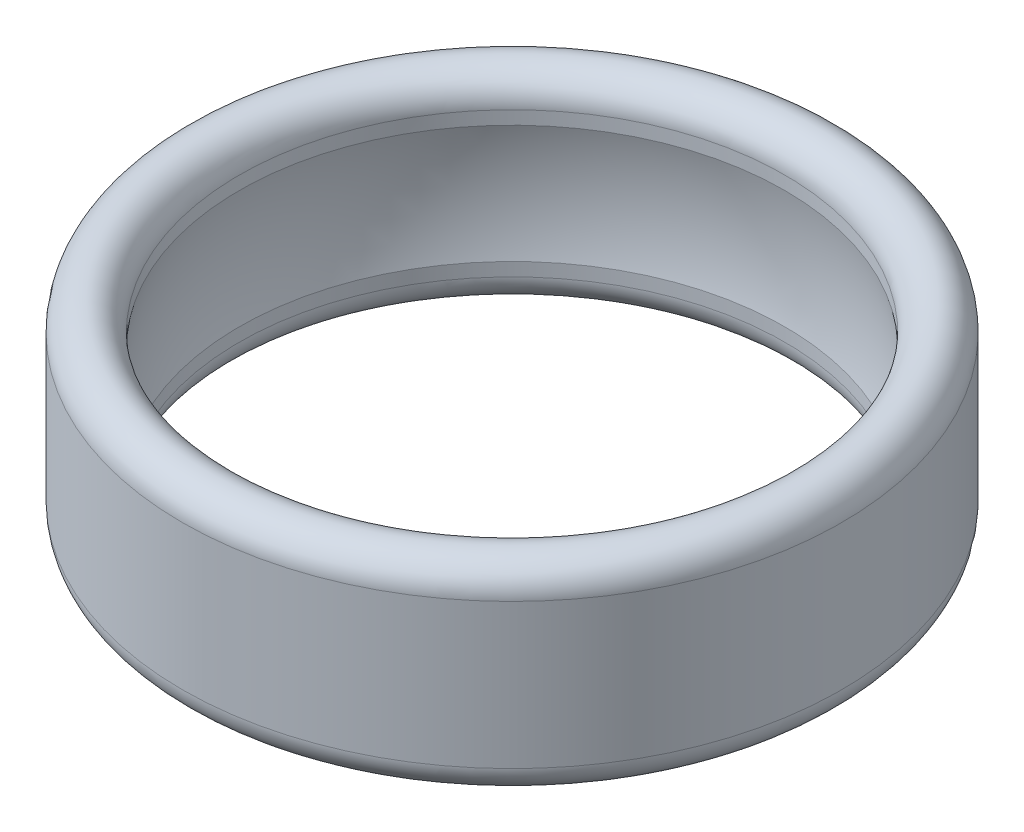
ISO-10303-21;
HEADER;
FILE_DESCRIPTION(('STEP AP214'),'2;1');
FILE_NAME('part.step','',(''),(''),'','','');
FILE_SCHEMA(('AUTOMOTIVE_DESIGN { 1 0 10303 214 1 1 1 1 }'));
ENDSEC;
DATA;
#1=APPLICATION_CONTEXT('core data for automotive mechanical design processes');
#2=APPLICATION_PROTOCOL_DEFINITION('international standard','automotive_design',2000,#1);
#3=PRODUCT_CONTEXT('',#1,'mechanical');
#4=PRODUCT('Part','Part','',(#3));
#5=PRODUCT_RELATED_PRODUCT_CATEGORY('part','',(#4));
#6=PRODUCT_DEFINITION_FORMATION('','',#4);
#7=PRODUCT_DEFINITION_CONTEXT('part definition',#1,'design');
#8=PRODUCT_DEFINITION('design','',#6,#7);
#9=PRODUCT_DEFINITION_SHAPE('','',#8);
#10=(LENGTH_UNIT() NAMED_UNIT(*) SI_UNIT(.MILLI.,.METRE.));
#11=(NAMED_UNIT(*) PLANE_ANGLE_UNIT() SI_UNIT($,.RADIAN.));
#12=(NAMED_UNIT(*) SI_UNIT($,.STERADIAN.) SOLID_ANGLE_UNIT());
#13=UNCERTAINTY_MEASURE_WITH_UNIT(LENGTH_MEASURE(1.E-05),#10,'distance_accuracy_value','');
#14=(GEOMETRIC_REPRESENTATION_CONTEXT(3) GLOBAL_UNCERTAINTY_ASSIGNED_CONTEXT((#13)) GLOBAL_UNIT_ASSIGNED_CONTEXT((#10,
#11,#12)) REPRESENTATION_CONTEXT('',''));
#15=CARTESIAN_POINT('',(0.,0.,0.));
#16=DIRECTION('',(0.,0.,1.));
#17=DIRECTION('',(1.,0.,0.));
#18=AXIS2_PLACEMENT_3D('',#15,#16,#17);
#19=CARTESIAN_POINT('',(0.,0.,0.));
#20=DIRECTION('',(0.,1.,0.));
#21=DIRECTION('',(0.,0.,1.));
#22=AXIS2_PLACEMENT_3D('',#19,#20,#21);
#23=CYLINDRICAL_SURFACE('',#22,5.3594);
#24=CARTESIAN_POINT('',(0.,3.14100972577401,0.));
#25=DIRECTION('',(0.,-1.,0.));
#26=DIRECTION('',(0.,0.,-1.));
#27=AXIS2_PLACEMENT_3D('',#24,#25,#26);
#28=CIRCLE('',#27,5.3594);
#29=CARTESIAN_POINT('',(0.,3.14100972577401,-5.3594));
#30=VERTEX_POINT('',#29);
#31=EDGE_CURVE('E57',#30,#30,#28,.T.);
#32=ORIENTED_EDGE('',*,*,#31,.T.);
#33=EDGE_LOOP('',(#32));
#34=FACE_BOUND('',#33,.T.);
#35=CARTESIAN_POINT('',(0.,3.4036,0.));
#36=DIRECTION('',(0.,1.,0.));
#37=DIRECTION('',(0.,0.,1.));
#38=AXIS2_PLACEMENT_3D('',#35,#36,#37);
#39=CIRCLE('',#38,5.3594);
#40=CARTESIAN_POINT('',(0.,3.4036,5.3594));
#41=VERTEX_POINT('',#40);
#42=EDGE_CURVE('E78',#41,#41,#39,.T.);
#43=ORIENTED_EDGE('',*,*,#42,.T.);
#44=EDGE_LOOP('',(#43));
#45=FACE_BOUND('',#44,.T.);
#46=ADVANCED_FACE('F52',(#34,#45),#23,.F.);
#47=CARTESIAN_POINT('',(0.,0.558800000000002,0.));
#48=DIRECTION('',(0.,1.,0.));
#49=DIRECTION('',(0.,0.,1.));
#50=AXIS2_PLACEMENT_3D('',#47,#48,#49);
#51=TOROIDAL_SURFACE('',#50,5.9182,0.5588);
#52=CARTESIAN_POINT('',(0.,0.558800000000002,0.));
#53=DIRECTION('',(0.,1.,0.));
#54=DIRECTION('',(0.,0.,1.));
#55=AXIS2_PLACEMENT_3D('',#52,#53,#54);
#56=CIRCLE('',#55,6.477);
#57=CARTESIAN_POINT('',(0.,0.558800000000002,6.477));
#58=VERTEX_POINT('',#57);
#59=EDGE_CURVE('E62',#58,#58,#56,.T.);
#60=ORIENTED_EDGE('',*,*,#59,.F.);
#61=EDGE_LOOP('',(#60));
#62=FACE_BOUND('',#61,.T.);
#63=CARTESIAN_POINT('',(0.,0.558800000000002,0.));
#64=DIRECTION('',(0.,1.,0.));
#65=DIRECTION('',(0.,0.,1.));
#66=AXIS2_PLACEMENT_3D('',#63,#64,#65);
#67=CIRCLE('',#66,5.3594);
#68=CARTESIAN_POINT('',(0.,0.558800000000002,5.3594));
#69=VERTEX_POINT('',#68);
#70=EDGE_CURVE('E12',#69,#69,#67,.F.);
#71=ORIENTED_EDGE('',*,*,#70,.F.);
#72=EDGE_LOOP('',(#71));
#73=FACE_BOUND('',#72,.T.);
#74=ADVANCED_FACE('F55',(#62,#73),#51,.T.);
#75=CARTESIAN_POINT('',(0.,3.4036,0.));
#76=DIRECTION('',(0.,1.,0.));
#77=DIRECTION('',(0.,0.,1.));
#78=AXIS2_PLACEMENT_3D('',#75,#76,#77);
#79=TOROIDAL_SURFACE('',#78,5.9182,0.5588);
#80=ORIENTED_EDGE('',*,*,#42,.F.);
#81=EDGE_LOOP('',(#80));
#82=FACE_BOUND('',#81,.T.);
#83=CARTESIAN_POINT('',(0.,3.4036,0.));
#84=DIRECTION('',(0.,1.,0.));
#85=DIRECTION('',(0.,0.,1.));
#86=AXIS2_PLACEMENT_3D('',#83,#84,#85);
#87=CIRCLE('',#86,6.477);
#88=CARTESIAN_POINT('',(0.,3.4036,6.477));
#89=VERTEX_POINT('',#88);
#90=EDGE_CURVE('E68',#89,#89,#87,.F.);
#91=ORIENTED_EDGE('',*,*,#90,.F.);
#92=EDGE_LOOP('',(#91));
#93=FACE_BOUND('',#92,.T.);
#94=ADVANCED_FACE('F92',(#82,#93),#79,.T.);
#95=CARTESIAN_POINT('',(0.,3.9624,0.));
#96=DIRECTION('',(0.,-1.,0.));
#97=DIRECTION('',(0.,0.,-1.));
#98=AXIS2_PLACEMENT_3D('',#95,#96,#97);
#99=CYLINDRICAL_SURFACE('',#98,6.477);
#100=ORIENTED_EDGE('',*,*,#59,.T.);
#101=EDGE_LOOP('',(#100));
#102=FACE_BOUND('',#101,.T.);
#103=ORIENTED_EDGE('',*,*,#90,.T.);
#104=EDGE_LOOP('',(#103));
#105=FACE_BOUND('',#104,.T.);
#106=ADVANCED_FACE('F90',(#102,#105),#99,.T.);
#107=CARTESIAN_POINT('',(0.,0.821390274225987,0.));
#108=DIRECTION('',(0.,1.,0.));
#109=DIRECTION('',(0.,0.,1.));
#110=AXIS2_PLACEMENT_3D('',#107,#108,#109);
#111=CIRCLE('',#110,5.3594);
#112=CARTESIAN_POINT('',(0.,0.821390274225987,5.3594));
#113=VERTEX_POINT('',#112);
#114=EDGE_CURVE('E71',#113,#113,#111,.T.);
#115=ORIENTED_EDGE('',*,*,#114,.T.);
#116=EDGE_LOOP('',(#115));
#117=FACE_BOUND('',#116,.T.);
#118=ORIENTED_EDGE('',*,*,#70,.T.);
#119=EDGE_LOOP('',(#118));
#120=FACE_BOUND('',#119,.T.);
#121=ADVANCED_FACE('F99',(#117,#120),#23,.F.);
#122=CARTESIAN_POINT('',(0.,1.9812,0.));
#123=DIRECTION('',(0.,1.,0.));
#124=DIRECTION('',(0.,0.,1.));
#125=AXIS2_PLACEMENT_3D('',#122,#123,#124);
#126=DEGENERATE_TOROIDAL_SURFACE('',#125,0.127,5.3594,.T.);
#127=ORIENTED_EDGE('',*,*,#114,.F.);
#128=EDGE_LOOP('',(#127));
#129=FACE_BOUND('',#128,.T.);
#130=ORIENTED_EDGE('',*,*,#31,.F.);
#131=EDGE_LOOP('',(#130));
#132=FACE_BOUND('',#131,.T.);
#133=ADVANCED_FACE('F110',(#129,#132),#126,.F.);
#134=CLOSED_SHELL('',(#46,#74,#94,#106,#121,#133));
#135=MANIFOLD_SOLID_BREP('B2',#134);
#136=ADVANCED_BREP_SHAPE_REPRESENTATION('',(#18,#135),#14);
#137=SHAPE_DEFINITION_REPRESENTATION(#9,#136);
ENDSEC;
END-ISO-10303-21;
